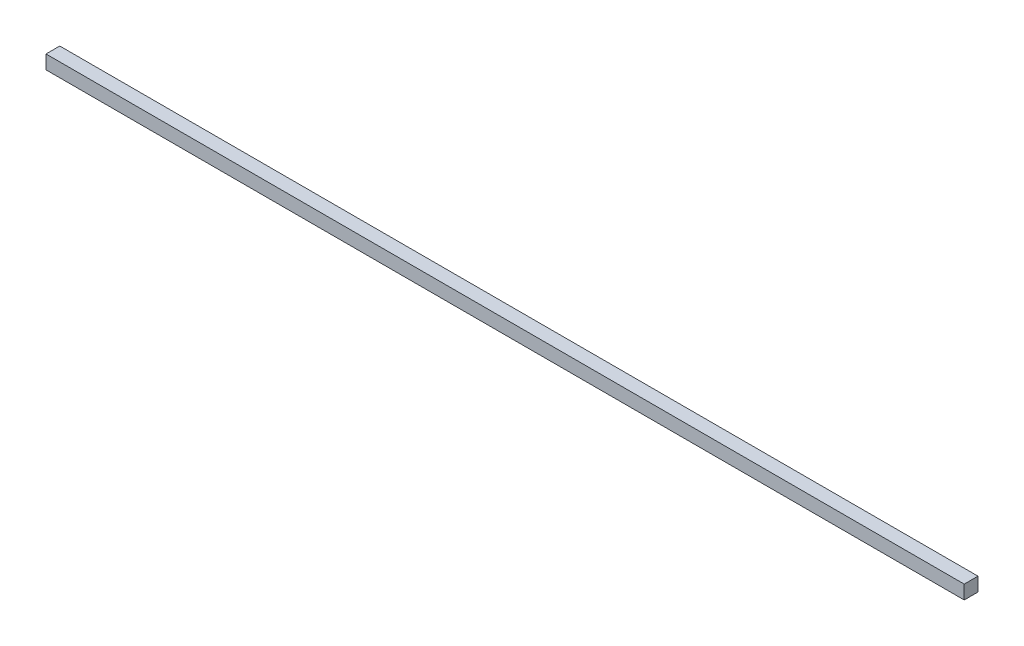
ISO-10303-21;
HEADER;
FILE_DESCRIPTION(('STEP AP214'),'2;1');
FILE_NAME('part.step','',(''),(''),'','','');
FILE_SCHEMA(('AUTOMOTIVE_DESIGN { 1 0 10303 214 1 1 1 1 }'));
ENDSEC;
DATA;
#1=APPLICATION_CONTEXT('core data for automotive mechanical design processes');
#2=APPLICATION_PROTOCOL_DEFINITION('international standard','automotive_design',2000,#1);
#3=PRODUCT_CONTEXT('',#1,'mechanical');
#4=PRODUCT('Part','Part','',(#3));
#5=PRODUCT_RELATED_PRODUCT_CATEGORY('part','',(#4));
#6=PRODUCT_DEFINITION_FORMATION('','',#4);
#7=PRODUCT_DEFINITION_CONTEXT('part definition',#1,'design');
#8=PRODUCT_DEFINITION('design','',#6,#7);
#9=PRODUCT_DEFINITION_SHAPE('','',#8);
#10=(LENGTH_UNIT() NAMED_UNIT(*) SI_UNIT(.MILLI.,.METRE.));
#11=(NAMED_UNIT(*) PLANE_ANGLE_UNIT() SI_UNIT($,.RADIAN.));
#12=(NAMED_UNIT(*) SI_UNIT($,.STERADIAN.) SOLID_ANGLE_UNIT());
#13=UNCERTAINTY_MEASURE_WITH_UNIT(LENGTH_MEASURE(1.E-05),#10,'distance_accuracy_value','');
#14=(GEOMETRIC_REPRESENTATION_CONTEXT(3) GLOBAL_UNCERTAINTY_ASSIGNED_CONTEXT((#13)) GLOBAL_UNIT_ASSIGNED_CONTEXT((#10,
#11,#12)) REPRESENTATION_CONTEXT('',''));
#15=CARTESIAN_POINT('',(0.,0.,0.));
#16=DIRECTION('',(0.,0.,1.));
#17=DIRECTION('',(1.,0.,0.));
#18=AXIS2_PLACEMENT_3D('',#15,#16,#17);
#19=CARTESIAN_POINT('',(0.,30.,0.));
#20=DIRECTION('',(1.,0.,0.));
#21=DIRECTION('',(0.,0.,-1.));
#22=AXIS2_PLACEMENT_3D('',#19,#20,#21);
#23=PLANE('',#22);
#24=DIRECTION('',(0.,0.,1.));
#25=VECTOR('',#24,1.);
#26=CARTESIAN_POINT('',(0.,0.,0.));
#27=LINE('',#26,#25);
#28=CARTESIAN_POINT('',(0.,0.,-30.));
#29=VERTEX_POINT('',#28);
#30=CARTESIAN_POINT('',(0.,0.,0.));
#31=VERTEX_POINT('',#30);
#32=EDGE_CURVE('E98',#29,#31,#27,.T.);
#33=ORIENTED_EDGE('',*,*,#32,.T.);
#34=DIRECTION('',(0.,-1.,0.));
#35=VECTOR('',#34,1.);
#36=CARTESIAN_POINT('',(0.,30.,0.));
#37=LINE('',#36,#35);
#38=CARTESIAN_POINT('',(0.,30.,0.));
#39=VERTEX_POINT('',#38);
#40=EDGE_CURVE('E11',#39,#31,#37,.T.);
#41=ORIENTED_EDGE('',*,*,#40,.F.);
#42=DIRECTION('',(0.,0.,1.));
#43=VECTOR('',#42,1.);
#44=CARTESIAN_POINT('',(0.,30.,0.));
#45=LINE('',#44,#43);
#46=CARTESIAN_POINT('',(0.,30.,-30.));
#47=VERTEX_POINT('',#46);
#48=EDGE_CURVE('E86',#47,#39,#45,.T.);
#49=ORIENTED_EDGE('',*,*,#48,.F.);
#50=DIRECTION('',(0.,-1.,0.));
#51=VECTOR('',#50,1.);
#52=CARTESIAN_POINT('',(0.,30.,-30.));
#53=LINE('',#52,#51);
#54=EDGE_CURVE('E94',#47,#29,#53,.T.);
#55=ORIENTED_EDGE('',*,*,#54,.T.);
#56=EDGE_LOOP('',(#33,#41,#49,#55));
#57=FACE_BOUND('',#56,.T.);
#58=ADVANCED_FACE('F35',(#57),#23,.F.);
#59=CARTESIAN_POINT('',(0.,30.,0.));
#60=DIRECTION('',(0.,0.,-1.));
#61=DIRECTION('',(-1.,0.,0.));
#62=AXIS2_PLACEMENT_3D('',#59,#60,#61);
#63=PLANE('',#62);
#64=DIRECTION('',(1.,0.,0.));
#65=VECTOR('',#64,1.);
#66=CARTESIAN_POINT('',(0.,0.,0.));
#67=LINE('',#66,#65);
#68=CARTESIAN_POINT('',(2000.,0.,0.));
#69=VERTEX_POINT('',#68);
#70=EDGE_CURVE('E90',#31,#69,#67,.T.);
#71=ORIENTED_EDGE('',*,*,#70,.T.);
#72=DIRECTION('',(0.,-1.,0.));
#73=VECTOR('',#72,1.);
#74=CARTESIAN_POINT('',(2000.,30.,0.));
#75=LINE('',#74,#73);
#76=CARTESIAN_POINT('',(2000.,30.,0.));
#77=VERTEX_POINT('',#76);
#78=EDGE_CURVE('E43',#77,#69,#75,.T.);
#79=ORIENTED_EDGE('',*,*,#78,.F.);
#80=DIRECTION('',(1.,0.,0.));
#81=VECTOR('',#80,1.);
#82=CARTESIAN_POINT('',(0.,30.,0.));
#83=LINE('',#82,#81);
#84=EDGE_CURVE('E81',#39,#77,#83,.T.);
#85=ORIENTED_EDGE('',*,*,#84,.F.);
#86=ORIENTED_EDGE('',*,*,#40,.T.);
#87=EDGE_LOOP('',(#71,#79,#85,#86));
#88=FACE_BOUND('',#87,.T.);
#89=ADVANCED_FACE('F89',(#88),#63,.F.);
#90=CARTESIAN_POINT('',(2000.,30.,0.));
#91=DIRECTION('',(-1.,0.,0.));
#92=DIRECTION('',(0.,0.,1.));
#93=AXIS2_PLACEMENT_3D('',#90,#91,#92);
#94=PLANE('',#93);
#95=DIRECTION('',(0.,0.,-1.));
#96=VECTOR('',#95,1.);
#97=CARTESIAN_POINT('',(2000.,0.,0.));
#98=LINE('',#97,#96);
#99=CARTESIAN_POINT('',(2000.,0.,-30.));
#100=VERTEX_POINT('',#99);
#101=EDGE_CURVE('E68',#69,#100,#98,.T.);
#102=ORIENTED_EDGE('',*,*,#101,.T.);
#103=DIRECTION('',(0.,-1.,0.));
#104=VECTOR('',#103,1.);
#105=CARTESIAN_POINT('',(2000.,30.,-30.));
#106=LINE('',#105,#104);
#107=CARTESIAN_POINT('',(2000.,30.,-30.));
#108=VERTEX_POINT('',#107);
#109=EDGE_CURVE('E91',#108,#100,#106,.T.);
#110=ORIENTED_EDGE('',*,*,#109,.F.);
#111=DIRECTION('',(0.,0.,-1.));
#112=VECTOR('',#111,1.);
#113=CARTESIAN_POINT('',(2000.,30.,0.));
#114=LINE('',#113,#112);
#115=EDGE_CURVE('E84',#77,#108,#114,.T.);
#116=ORIENTED_EDGE('',*,*,#115,.F.);
#117=ORIENTED_EDGE('',*,*,#78,.T.);
#118=EDGE_LOOP('',(#102,#110,#116,#117));
#119=FACE_BOUND('',#118,.T.);
#120=ADVANCED_FACE('F92',(#119),#94,.F.);
#121=CARTESIAN_POINT('',(0.,30.,-30.));
#122=DIRECTION('',(0.,0.,1.));
#123=DIRECTION('',(1.,0.,0.));
#124=AXIS2_PLACEMENT_3D('',#121,#122,#123);
#125=PLANE('',#124);
#126=DIRECTION('',(-1.,0.,0.));
#127=VECTOR('',#126,1.);
#128=CARTESIAN_POINT('',(0.,0.,-30.));
#129=LINE('',#128,#127);
#130=EDGE_CURVE('E74',#100,#29,#129,.T.);
#131=ORIENTED_EDGE('',*,*,#130,.T.);
#132=ORIENTED_EDGE('',*,*,#54,.F.);
#133=DIRECTION('',(-1.,0.,0.));
#134=VECTOR('',#133,1.);
#135=CARTESIAN_POINT('',(0.,30.,-30.));
#136=LINE('',#135,#134);
#137=EDGE_CURVE('E51',#108,#47,#136,.T.);
#138=ORIENTED_EDGE('',*,*,#137,.F.);
#139=ORIENTED_EDGE('',*,*,#109,.T.);
#140=EDGE_LOOP('',(#131,#132,#138,#139));
#141=FACE_BOUND('',#140,.T.);
#142=ADVANCED_FACE('F105',(#141),#125,.F.);
#143=CARTESIAN_POINT('',(0.,30.,0.));
#144=DIRECTION('',(0.,-1.,0.));
#145=DIRECTION('',(0.,0.,-1.));
#146=AXIS2_PLACEMENT_3D('',#143,#144,#145);
#147=PLANE('',#146);
#148=ORIENTED_EDGE('',*,*,#48,.T.);
#149=ORIENTED_EDGE('',*,*,#84,.T.);
#150=ORIENTED_EDGE('',*,*,#115,.T.);
#151=ORIENTED_EDGE('',*,*,#137,.T.);
#152=EDGE_LOOP('',(#148,#149,#150,#151));
#153=FACE_BOUND('',#152,.T.);
#154=ADVANCED_FACE('F82',(#153),#147,.F.);
#155=CARTESIAN_POINT('',(0.,0.,0.));
#156=DIRECTION('',(0.,-1.,0.));
#157=DIRECTION('',(0.,0.,-1.));
#158=AXIS2_PLACEMENT_3D('',#155,#156,#157);
#159=PLANE('',#158);
#160=ORIENTED_EDGE('',*,*,#32,.F.);
#161=ORIENTED_EDGE('',*,*,#130,.F.);
#162=ORIENTED_EDGE('',*,*,#101,.F.);
#163=ORIENTED_EDGE('',*,*,#70,.F.);
#164=EDGE_LOOP('',(#160,#161,#162,#163));
#165=FACE_BOUND('',#164,.T.);
#166=ADVANCED_FACE('F108',(#165),#159,.T.);
#167=CLOSED_SHELL('',(#58,#89,#120,#142,#154,#166));
#168=MANIFOLD_SOLID_BREP('B2',#167);
#169=ADVANCED_BREP_SHAPE_REPRESENTATION('',(#18,#168),#14);
#170=SHAPE_DEFINITION_REPRESENTATION(#9,#169);
ENDSEC;
END-ISO-10303-21;
